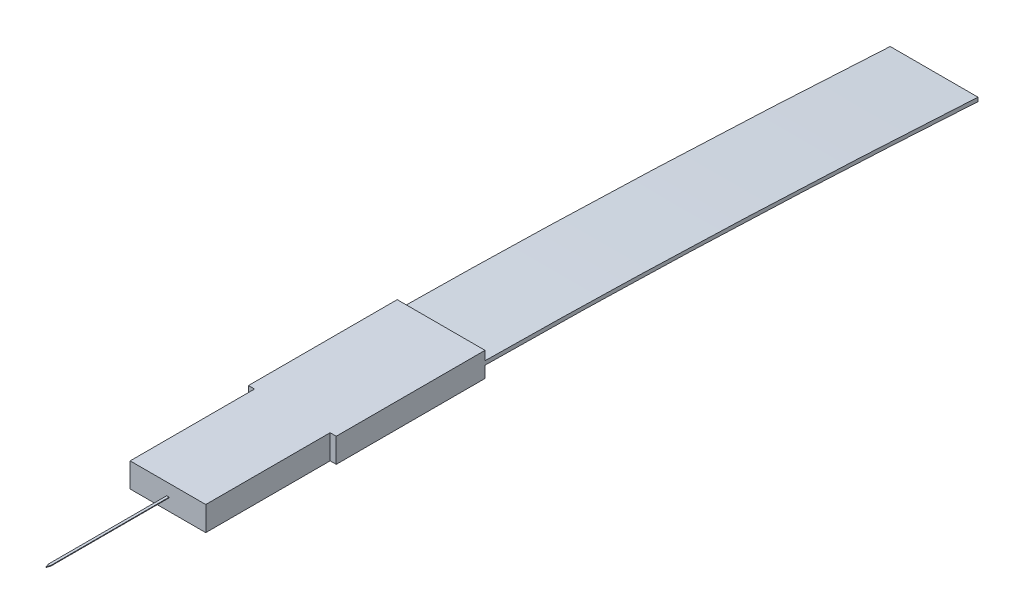
ISO-10303-21;
HEADER;
FILE_DESCRIPTION(('STEP AP214'),'2;1');
FILE_NAME('part.step','',(''),(''),'','','');
FILE_SCHEMA(('AUTOMOTIVE_DESIGN { 1 0 10303 214 1 1 1 1 }'));
ENDSEC;
DATA;
#1=APPLICATION_CONTEXT('core data for automotive mechanical design processes');
#2=APPLICATION_PROTOCOL_DEFINITION('international standard','automotive_design',2000,#1);
#3=PRODUCT_CONTEXT('',#1,'mechanical');
#4=PRODUCT('Part','Part','',(#3));
#5=PRODUCT_RELATED_PRODUCT_CATEGORY('part','',(#4));
#6=PRODUCT_DEFINITION_FORMATION('','',#4);
#7=PRODUCT_DEFINITION_CONTEXT('part definition',#1,'design');
#8=PRODUCT_DEFINITION('design','',#6,#7);
#9=PRODUCT_DEFINITION_SHAPE('','',#8);
#10=(LENGTH_UNIT() NAMED_UNIT(*) SI_UNIT(.MILLI.,.METRE.));
#11=(NAMED_UNIT(*) PLANE_ANGLE_UNIT() SI_UNIT($,.RADIAN.));
#12=(NAMED_UNIT(*) SI_UNIT($,.STERADIAN.) SOLID_ANGLE_UNIT());
#13=UNCERTAINTY_MEASURE_WITH_UNIT(LENGTH_MEASURE(1.E-05),#10,'distance_accuracy_value','');
#14=(GEOMETRIC_REPRESENTATION_CONTEXT(3) GLOBAL_UNCERTAINTY_ASSIGNED_CONTEXT((#13)) GLOBAL_UNIT_ASSIGNED_CONTEXT((#10,
#11,#12)) REPRESENTATION_CONTEXT('',''));
#15=CARTESIAN_POINT('',(0.,0.,0.));
#16=DIRECTION('',(0.,0.,1.));
#17=DIRECTION('',(1.,0.,0.));
#18=AXIS2_PLACEMENT_3D('',#15,#16,#17);
#19=CARTESIAN_POINT('',(0.,2.,-6.1));
#20=DIRECTION('',(0.,0.,-1.));
#21=DIRECTION('',(-1.,0.,0.));
#22=AXIS2_PLACEMENT_3D('',#19,#20,#21);
#23=PLANE('',#22);
#24=DIRECTION('',(0.,-1.,0.));
#25=VECTOR('',#24,1.);
#26=CARTESIAN_POINT('',(-3.6,2.,-6.1));
#27=LINE('',#26,#25);
#28=CARTESIAN_POINT('',(-3.6,0.94234822080572,-6.1));
#29=VERTEX_POINT('',#28);
#30=CARTESIAN_POINT('',(-3.6,0.,-6.1));
#31=VERTEX_POINT('',#30);
#32=EDGE_CURVE('E211',#29,#31,#27,.T.);
#33=ORIENTED_EDGE('',*,*,#32,.F.);
#34=DIRECTION('',(1.,0.,0.));
#35=VECTOR('',#34,1.);
#36=CARTESIAN_POINT('',(-3.6,0.94234822080572,-6.1));
#37=LINE('',#36,#35);
#38=CARTESIAN_POINT('',(3.6,0.94234822080572,-6.1));
#39=VERTEX_POINT('',#38);
#40=EDGE_CURVE('E202',#29,#39,#37,.T.);
#41=ORIENTED_EDGE('',*,*,#40,.T.);
#42=DIRECTION('',(0.,-1.,0.));
#43=VECTOR('',#42,1.);
#44=CARTESIAN_POINT('',(3.6,2.,-6.1));
#45=LINE('',#44,#43);
#46=CARTESIAN_POINT('',(3.6,0.,-6.1));
#47=VERTEX_POINT('',#46);
#48=EDGE_CURVE('E210',#39,#47,#45,.T.);
#49=ORIENTED_EDGE('',*,*,#48,.T.);
#50=DIRECTION('',(1.,0.,0.));
#51=VECTOR('',#50,1.);
#52=CARTESIAN_POINT('',(0.,0.,-6.1));
#53=LINE('',#52,#51);
#54=EDGE_CURVE('E254',#31,#47,#53,.T.);
#55=ORIENTED_EDGE('',*,*,#54,.F.);
#56=EDGE_LOOP('',(#33,#41,#49,#55));
#57=FACE_BOUND('',#56,.T.);
#58=ADVANCED_FACE('F60',(#57),#23,.T.);
#59=CARTESIAN_POINT('',(0.,2.,16.3));
#60=DIRECTION('',(0.,0.,-1.));
#61=DIRECTION('',(-1.,0.,0.));
#62=AXIS2_PLACEMENT_3D('',#59,#60,#61);
#63=PLANE('',#62);
#64=DIRECTION('',(1.,0.,0.));
#65=VECTOR('',#64,1.);
#66=CARTESIAN_POINT('',(0.,0.,16.3));
#67=LINE('',#66,#65);
#68=CARTESIAN_POINT('',(-3.1,0.,16.3));
#69=VERTEX_POINT('',#68);
#70=CARTESIAN_POINT('',(3.1,0.,16.3));
#71=VERTEX_POINT('',#70);
#72=EDGE_CURVE('E233',#69,#71,#67,.T.);
#73=ORIENTED_EDGE('',*,*,#72,.T.);
#74=DIRECTION('',(0.,-1.,0.));
#75=VECTOR('',#74,1.);
#76=CARTESIAN_POINT('',(3.1,2.,16.3));
#77=LINE('',#76,#75);
#78=CARTESIAN_POINT('',(3.1,2.,16.3));
#79=VERTEX_POINT('',#78);
#80=EDGE_CURVE('E223',#79,#71,#77,.T.);
#81=ORIENTED_EDGE('',*,*,#80,.F.);
#82=DIRECTION('',(1.,0.,0.));
#83=VECTOR('',#82,1.);
#84=CARTESIAN_POINT('',(0.,2.,16.3));
#85=LINE('',#84,#83);
#86=CARTESIAN_POINT('',(-3.1,2.,16.3));
#87=VERTEX_POINT('',#86);
#88=EDGE_CURVE('E235',#87,#79,#85,.T.);
#89=ORIENTED_EDGE('',*,*,#88,.F.);
#90=DIRECTION('',(0.,-1.,0.));
#91=VECTOR('',#90,1.);
#92=CARTESIAN_POINT('',(-3.1,2.,16.3));
#93=LINE('',#92,#91);
#94=EDGE_CURVE('E68',#87,#69,#93,.T.);
#95=ORIENTED_EDGE('',*,*,#94,.T.);
#96=EDGE_LOOP('',(#73,#81,#89,#95));
#97=FACE_BOUND('',#96,.T.);
#98=DIRECTION('',(0.,1.,0.));
#99=VECTOR('',#98,1.);
#100=CARTESIAN_POINT('',(0.1,0.975,16.3));
#101=LINE('',#100,#99);
#102=CARTESIAN_POINT('',(0.1,0.975,16.3));
#103=VERTEX_POINT('',#102);
#104=CARTESIAN_POINT('',(0.1,1.025,16.3));
#105=VERTEX_POINT('',#104);
#106=EDGE_CURVE('E327',#103,#105,#101,.T.);
#107=ORIENTED_EDGE('',*,*,#106,.F.);
#108=DIRECTION('',(1.,0.,0.));
#109=VECTOR('',#108,1.);
#110=CARTESIAN_POINT('',(-0.1,0.975,16.3));
#111=LINE('',#110,#109);
#112=CARTESIAN_POINT('',(-0.1,0.975,16.3));
#113=VERTEX_POINT('',#112);
#114=EDGE_CURVE('E335',#113,#103,#111,.T.);
#115=ORIENTED_EDGE('',*,*,#114,.F.);
#116=DIRECTION('',(0.,-1.,0.));
#117=VECTOR('',#116,1.);
#118=CARTESIAN_POINT('',(-0.1,0.975,16.3));
#119=LINE('',#118,#117);
#120=CARTESIAN_POINT('',(-0.1,1.025,16.3));
#121=VERTEX_POINT('',#120);
#122=EDGE_CURVE('E332',#121,#113,#119,.T.);
#123=ORIENTED_EDGE('',*,*,#122,.F.);
#124=DIRECTION('',(-1.,0.,0.));
#125=VECTOR('',#124,1.);
#126=CARTESIAN_POINT('',(-0.1,1.025,16.3));
#127=LINE('',#126,#125);
#128=EDGE_CURVE('E330',#105,#121,#127,.T.);
#129=ORIENTED_EDGE('',*,*,#128,.F.);
#130=EDGE_LOOP('',(#107,#115,#123,#129));
#131=FACE_BOUND('',#130,.T.);
#132=ADVANCED_FACE('F230',(#97,#131),#63,.F.);
#133=CARTESIAN_POINT('',(0.,2.,6.1));
#134=DIRECTION('',(0.,0.,-1.));
#135=DIRECTION('',(-1.,0.,0.));
#136=AXIS2_PLACEMENT_3D('',#133,#134,#135);
#137=PLANE('',#136);
#138=DIRECTION('',(1.,0.,0.));
#139=VECTOR('',#138,1.);
#140=CARTESIAN_POINT('',(0.,0.,6.1));
#141=LINE('',#140,#139);
#142=CARTESIAN_POINT('',(-3.6,0.,6.1));
#143=VERTEX_POINT('',#142);
#144=CARTESIAN_POINT('',(-3.1,0.,6.1));
#145=VERTEX_POINT('',#144);
#146=EDGE_CURVE('E247',#143,#145,#141,.T.);
#147=ORIENTED_EDGE('',*,*,#146,.T.);
#148=DIRECTION('',(0.,-1.,0.));
#149=VECTOR('',#148,1.);
#150=CARTESIAN_POINT('',(-3.1,2.,6.1));
#151=LINE('',#150,#149);
#152=CARTESIAN_POINT('',(-3.1,2.,6.1));
#153=VERTEX_POINT('',#152);
#154=EDGE_CURVE('E12',#153,#145,#151,.T.);
#155=ORIENTED_EDGE('',*,*,#154,.F.);
#156=DIRECTION('',(1.,0.,0.));
#157=VECTOR('',#156,1.);
#158=CARTESIAN_POINT('',(0.,2.,6.1));
#159=LINE('',#158,#157);
#160=CARTESIAN_POINT('',(-3.6,2.,6.1));
#161=VERTEX_POINT('',#160);
#162=EDGE_CURVE('E258',#161,#153,#159,.T.);
#163=ORIENTED_EDGE('',*,*,#162,.F.);
#164=DIRECTION('',(0.,-1.,0.));
#165=VECTOR('',#164,1.);
#166=CARTESIAN_POINT('',(-3.6,2.,6.1));
#167=LINE('',#166,#165);
#168=EDGE_CURVE('E214',#161,#143,#167,.T.);
#169=ORIENTED_EDGE('',*,*,#168,.T.);
#170=EDGE_LOOP('',(#147,#155,#163,#169));
#171=FACE_BOUND('',#170,.T.);
#172=ADVANCED_FACE('F368',(#171),#137,.F.);
#173=CARTESIAN_POINT('',(-3.1,2.,0.));
#174=DIRECTION('',(1.,0.,0.));
#175=DIRECTION('',(0.,0.,-1.));
#176=AXIS2_PLACEMENT_3D('',#173,#174,#175);
#177=PLANE('',#176);
#178=DIRECTION('',(0.,0.,1.));
#179=VECTOR('',#178,1.);
#180=CARTESIAN_POINT('',(-3.1,0.,0.));
#181=LINE('',#180,#179);
#182=EDGE_CURVE('E240',#145,#69,#181,.T.);
#183=ORIENTED_EDGE('',*,*,#182,.T.);
#184=ORIENTED_EDGE('',*,*,#94,.F.);
#185=DIRECTION('',(0.,0.,1.));
#186=VECTOR('',#185,1.);
#187=CARTESIAN_POINT('',(-3.1,2.,0.));
#188=LINE('',#187,#186);
#189=EDGE_CURVE('E260',#153,#87,#188,.T.);
#190=ORIENTED_EDGE('',*,*,#189,.F.);
#191=ORIENTED_EDGE('',*,*,#154,.T.);
#192=EDGE_LOOP('',(#183,#184,#190,#191));
#193=FACE_BOUND('',#192,.T.);
#194=ADVANCED_FACE('F62',(#193),#177,.F.);
#195=CARTESIAN_POINT('',(3.1,2.,0.));
#196=DIRECTION('',(1.,0.,0.));
#197=DIRECTION('',(0.,0.,-1.));
#198=AXIS2_PLACEMENT_3D('',#195,#196,#197);
#199=PLANE('',#198);
#200=DIRECTION('',(0.,0.,1.));
#201=VECTOR('',#200,1.);
#202=CARTESIAN_POINT('',(3.1,0.,0.));
#203=LINE('',#202,#201);
#204=CARTESIAN_POINT('',(3.1,0.,6.1));
#205=VERTEX_POINT('',#204);
#206=EDGE_CURVE('E243',#205,#71,#203,.T.);
#207=ORIENTED_EDGE('',*,*,#206,.F.);
#208=DIRECTION('',(0.,-1.,0.));
#209=VECTOR('',#208,1.);
#210=CARTESIAN_POINT('',(3.1,2.,6.1));
#211=LINE('',#210,#209);
#212=CARTESIAN_POINT('',(3.1,2.,6.1));
#213=VERTEX_POINT('',#212);
#214=EDGE_CURVE('E221',#213,#205,#211,.T.);
#215=ORIENTED_EDGE('',*,*,#214,.F.);
#216=DIRECTION('',(0.,0.,1.));
#217=VECTOR('',#216,1.);
#218=CARTESIAN_POINT('',(3.1,2.,0.));
#219=LINE('',#218,#217);
#220=EDGE_CURVE('E269',#213,#79,#219,.T.);
#221=ORIENTED_EDGE('',*,*,#220,.T.);
#222=ORIENTED_EDGE('',*,*,#80,.T.);
#223=EDGE_LOOP('',(#207,#215,#221,#222));
#224=FACE_BOUND('',#223,.T.);
#225=ADVANCED_FACE('F380',(#224),#199,.T.);
#226=CARTESIAN_POINT('',(3.6,0.,6.1));
#227=VERTEX_POINT('',#226);
#228=EDGE_CURVE('E245',#205,#227,#141,.T.);
#229=ORIENTED_EDGE('',*,*,#228,.T.);
#230=DIRECTION('',(0.,-1.,0.));
#231=VECTOR('',#230,1.);
#232=CARTESIAN_POINT('',(3.6,2.,6.1));
#233=LINE('',#232,#231);
#234=CARTESIAN_POINT('',(3.6,2.,6.1));
#235=VERTEX_POINT('',#234);
#236=EDGE_CURVE('E218',#235,#227,#233,.T.);
#237=ORIENTED_EDGE('',*,*,#236,.F.);
#238=EDGE_CURVE('E262',#213,#235,#159,.T.);
#239=ORIENTED_EDGE('',*,*,#238,.F.);
#240=ORIENTED_EDGE('',*,*,#214,.T.);
#241=EDGE_LOOP('',(#229,#237,#239,#240));
#242=FACE_BOUND('',#241,.T.);
#243=ADVANCED_FACE('F285',(#242),#137,.F.);
#244=CARTESIAN_POINT('',(3.6,2.,0.));
#245=DIRECTION('',(-1.,0.,0.));
#246=DIRECTION('',(0.,0.,1.));
#247=AXIS2_PLACEMENT_3D('',#244,#245,#246);
#248=PLANE('',#247);
#249=DIRECTION('',(0.,0.,-1.));
#250=VECTOR('',#249,1.);
#251=CARTESIAN_POINT('',(3.6,0.,0.));
#252=LINE('',#251,#250);
#253=EDGE_CURVE('E251',#227,#47,#252,.T.);
#254=ORIENTED_EDGE('',*,*,#253,.T.);
#255=ORIENTED_EDGE('',*,*,#48,.F.);
#256=CARTESIAN_POINT('',(3.6,0.94234822080572,-6.1));
#257=CARTESIAN_POINT('',(3.6,0.810344541487121,-24.5183183228742));
#258=CARTESIAN_POINT('',(3.6,-0.554134336022549,-46.5258868403928));
#259=B_SPLINE_CURVE_WITH_KNOTS('',2,(#256,#257,#258),.UNSPECIFIED.,.F.,.F.,(3,3),(0.,1.),.UNSPECIFIED.);
#260=CARTESIAN_POINT('',(3.6,-0.554134336022548,-46.5258868403928));
#261=VERTEX_POINT('',#260);
#262=EDGE_CURVE('E75',#39,#261,#259,.T.);
#263=ORIENTED_EDGE('',*,*,#262,.T.);
#264=DIRECTION('',(0.,1.,0.));
#265=VECTOR('',#264,1.);
#266=CARTESIAN_POINT('',(3.6,-0.234680928592633,-46.5258868403928));
#267=LINE('',#266,#265);
#268=CARTESIAN_POINT('',(3.6,-0.234680928592633,-46.5258868403928));
#269=VERTEX_POINT('',#268);
#270=EDGE_CURVE('E192',#261,#269,#267,.T.);
#271=ORIENTED_EDGE('',*,*,#270,.T.);
#272=CARTESIAN_POINT('',(3.6,-0.234680928592635,-46.5258868403928));
#273=CARTESIAN_POINT('',(3.6,1.083380730753,-24.5624307551034));
#274=CARTESIAN_POINT('',(3.6,1.26180162823563,-6.1));
#275=B_SPLINE_CURVE_WITH_KNOTS('',2,(#272,#273,#274),.UNSPECIFIED.,.F.,.F.,(3,3),(0.,1.),.UNSPECIFIED.);
#276=CARTESIAN_POINT('',(3.6,1.26180162823563,-6.1));
#277=VERTEX_POINT('',#276);
#278=EDGE_CURVE('E296',#269,#277,#275,.T.);
#279=ORIENTED_EDGE('',*,*,#278,.T.);
#280=CARTESIAN_POINT('',(3.6,2.,-6.1));
#281=VERTEX_POINT('',#280);
#282=EDGE_CURVE('E201',#281,#277,#45,.T.);
#283=ORIENTED_EDGE('',*,*,#282,.F.);
#284=DIRECTION('',(0.,0.,-1.));
#285=VECTOR('',#284,1.);
#286=CARTESIAN_POINT('',(3.6,2.,0.));
#287=LINE('',#286,#285);
#288=EDGE_CURVE('E268',#235,#281,#287,.T.);
#289=ORIENTED_EDGE('',*,*,#288,.F.);
#290=ORIENTED_EDGE('',*,*,#236,.T.);
#291=EDGE_LOOP('',(#254,#255,#263,#271,#279,#283,#289,#290));
#292=FACE_BOUND('',#291,.T.);
#293=ADVANCED_FACE('F289',(#292),#248,.F.);
#294=DIRECTION('',(1.,0.,0.));
#295=VECTOR('',#294,1.);
#296=CARTESIAN_POINT('',(-3.6,1.26180162823563,-6.1));
#297=LINE('',#296,#295);
#298=CARTESIAN_POINT('',(-3.6,1.26180162823563,-6.1));
#299=VERTEX_POINT('',#298);
#300=EDGE_CURVE('E184',#299,#277,#297,.T.);
#301=ORIENTED_EDGE('',*,*,#300,.F.);
#302=CARTESIAN_POINT('',(-3.6,2.,-6.1));
#303=VERTEX_POINT('',#302);
#304=EDGE_CURVE('E198',#303,#299,#27,.T.);
#305=ORIENTED_EDGE('',*,*,#304,.F.);
#306=DIRECTION('',(1.,0.,0.));
#307=VECTOR('',#306,1.);
#308=CARTESIAN_POINT('',(0.,2.,-6.1));
#309=LINE('',#308,#307);
#310=EDGE_CURVE('E273',#303,#281,#309,.T.);
#311=ORIENTED_EDGE('',*,*,#310,.T.);
#312=ORIENTED_EDGE('',*,*,#282,.T.);
#313=EDGE_LOOP('',(#301,#305,#311,#312));
#314=FACE_BOUND('',#313,.T.);
#315=ADVANCED_FACE('F196',(#314),#23,.T.);
#316=CARTESIAN_POINT('',(-3.6,2.,0.));
#317=DIRECTION('',(-1.,0.,0.));
#318=DIRECTION('',(0.,0.,1.));
#319=AXIS2_PLACEMENT_3D('',#316,#317,#318);
#320=PLANE('',#319);
#321=DIRECTION('',(0.,0.,-1.));
#322=VECTOR('',#321,1.);
#323=CARTESIAN_POINT('',(-3.6,0.,0.));
#324=LINE('',#323,#322);
#325=EDGE_CURVE('E256',#143,#31,#324,.T.);
#326=ORIENTED_EDGE('',*,*,#325,.F.);
#327=ORIENTED_EDGE('',*,*,#168,.F.);
#328=DIRECTION('',(0.,0.,-1.));
#329=VECTOR('',#328,1.);
#330=CARTESIAN_POINT('',(-3.6,2.,0.));
#331=LINE('',#330,#329);
#332=EDGE_CURVE('E209',#161,#303,#331,.T.);
#333=ORIENTED_EDGE('',*,*,#332,.T.);
#334=ORIENTED_EDGE('',*,*,#304,.T.);
#335=CARTESIAN_POINT('',(-3.6,-0.234680928592635,-46.5258868403928));
#336=CARTESIAN_POINT('',(-3.6,1.083380730753,-24.5624307551034));
#337=CARTESIAN_POINT('',(-3.6,1.26180162823563,-6.1));
#338=B_SPLINE_CURVE_WITH_KNOTS('',2,(#335,#336,#337),.UNSPECIFIED.,.F.,.F.,(3,3),(0.,1.),.UNSPECIFIED.);
#339=CARTESIAN_POINT('',(-3.6,-0.234680928592633,-46.5258868403928));
#340=VERTEX_POINT('',#339);
#341=EDGE_CURVE('E180',#340,#299,#338,.T.);
#342=ORIENTED_EDGE('',*,*,#341,.F.);
#343=DIRECTION('',(0.,1.,0.));
#344=VECTOR('',#343,1.);
#345=CARTESIAN_POINT('',(-3.6,-0.234680928592633,-46.5258868403928));
#346=LINE('',#345,#344);
#347=CARTESIAN_POINT('',(-3.6,-0.554134336022548,-46.5258868403928));
#348=VERTEX_POINT('',#347);
#349=EDGE_CURVE('E203',#348,#340,#346,.T.);
#350=ORIENTED_EDGE('',*,*,#349,.F.);
#351=CARTESIAN_POINT('',(-3.6,0.94234822080572,-6.1));
#352=CARTESIAN_POINT('',(-3.6,0.810344541487121,-24.5183183228742));
#353=CARTESIAN_POINT('',(-3.6,-0.554134336022549,-46.5258868403928));
#354=B_SPLINE_CURVE_WITH_KNOTS('',2,(#351,#352,#353),.UNSPECIFIED.,.F.,.F.,(3,3),(0.,1.),.UNSPECIFIED.);
#355=EDGE_CURVE('E191',#29,#348,#354,.T.);
#356=ORIENTED_EDGE('',*,*,#355,.F.);
#357=ORIENTED_EDGE('',*,*,#32,.T.);
#358=EDGE_LOOP('',(#326,#327,#333,#334,#342,#350,#356,#357));
#359=FACE_BOUND('',#358,.T.);
#360=ADVANCED_FACE('F207',(#359),#320,.T.);
#361=CARTESIAN_POINT('',(0.,2.,0.));
#362=DIRECTION('',(0.,1.,0.));
#363=DIRECTION('',(0.,0.,1.));
#364=AXIS2_PLACEMENT_3D('',#361,#362,#363);
#365=PLANE('',#364);
#366=ORIENTED_EDGE('',*,*,#162,.T.);
#367=ORIENTED_EDGE('',*,*,#189,.T.);
#368=ORIENTED_EDGE('',*,*,#88,.T.);
#369=ORIENTED_EDGE('',*,*,#220,.F.);
#370=ORIENTED_EDGE('',*,*,#238,.T.);
#371=ORIENTED_EDGE('',*,*,#288,.T.);
#372=ORIENTED_EDGE('',*,*,#310,.F.);
#373=ORIENTED_EDGE('',*,*,#332,.F.);
#374=EDGE_LOOP('',(#366,#367,#368,#369,#370,#371,#372,#373));
#375=FACE_BOUND('',#374,.T.);
#376=ADVANCED_FACE('F376',(#375),#365,.T.);
#377=CARTESIAN_POINT('',(0.,0.,0.));
#378=DIRECTION('',(0.,1.,0.));
#379=DIRECTION('',(0.,0.,1.));
#380=AXIS2_PLACEMENT_3D('',#377,#378,#379);
#381=PLANE('',#380);
#382=ORIENTED_EDGE('',*,*,#146,.F.);
#383=ORIENTED_EDGE('',*,*,#325,.T.);
#384=ORIENTED_EDGE('',*,*,#54,.T.);
#385=ORIENTED_EDGE('',*,*,#253,.F.);
#386=ORIENTED_EDGE('',*,*,#228,.F.);
#387=ORIENTED_EDGE('',*,*,#206,.T.);
#388=ORIENTED_EDGE('',*,*,#72,.F.);
#389=ORIENTED_EDGE('',*,*,#182,.F.);
#390=EDGE_LOOP('',(#382,#383,#384,#385,#386,#387,#388,#389));
#391=FACE_BOUND('',#390,.T.);
#392=ADVANCED_FACE('F239',(#391),#381,.F.);
#393=CARTESIAN_POINT('',(0.1,0.975,26.3));
#394=DIRECTION('',(-1.,0.,0.));
#395=DIRECTION('',(0.,0.,1.));
#396=AXIS2_PLACEMENT_3D('',#393,#394,#395);
#397=PLANE('',#396);
#398=DIRECTION('',(0.,0.,-1.));
#399=VECTOR('',#398,1.);
#400=CARTESIAN_POINT('',(0.1,1.025,26.3));
#401=LINE('',#400,#399);
#402=CARTESIAN_POINT('',(0.100000000000001,1.025,26.));
#403=VERTEX_POINT('',#402);
#404=EDGE_CURVE('E83',#403,#105,#401,.T.);
#405=ORIENTED_EDGE('',*,*,#404,.F.);
#406=DIRECTION('',(0.,-1.,0.));
#407=VECTOR('',#406,1.);
#408=CARTESIAN_POINT('',(0.100000000000001,1.34122776601685,26.));
#409=LINE('',#408,#407);
#410=CARTESIAN_POINT('',(0.100000000000001,0.975,26.));
#411=VERTEX_POINT('',#410);
#412=EDGE_CURVE('E319',#403,#411,#409,.T.);
#413=ORIENTED_EDGE('',*,*,#412,.T.);
#414=DIRECTION('',(0.,0.,-1.));
#415=VECTOR('',#414,1.);
#416=CARTESIAN_POINT('',(0.1,0.975,26.3));
#417=LINE('',#416,#415);
#418=EDGE_CURVE('E338',#411,#103,#417,.T.);
#419=ORIENTED_EDGE('',*,*,#418,.T.);
#420=ORIENTED_EDGE('',*,*,#106,.T.);
#421=EDGE_LOOP('',(#405,#413,#419,#420));
#422=FACE_BOUND('',#421,.T.);
#423=ADVANCED_FACE('F353',(#422),#397,.F.);
#424=CARTESIAN_POINT('',(-0.1,1.025,26.3));
#425=DIRECTION('',(0.,-1.,0.));
#426=DIRECTION('',(0.,0.,-1.));
#427=AXIS2_PLACEMENT_3D('',#424,#425,#426);
#428=PLANE('',#427);
#429=DIRECTION('',(0.,0.,-1.));
#430=VECTOR('',#429,1.);
#431=CARTESIAN_POINT('',(-0.1,1.025,26.3));
#432=LINE('',#431,#430);
#433=CARTESIAN_POINT('',(-0.100000000000002,1.025,26.));
#434=VERTEX_POINT('',#433);
#435=EDGE_CURVE('E283',#434,#121,#432,.T.);
#436=ORIENTED_EDGE('',*,*,#435,.F.);
#437=DIRECTION('',(-0.316227766016836,0.,-0.948683298050514));
#438=VECTOR('',#437,1.);
#439=CARTESIAN_POINT('',(-7.88999999999997,1.025,2.62999999999997));
#440=LINE('',#439,#438);
#441=CARTESIAN_POINT('',(0.,1.025,26.3));
#442=VERTEX_POINT('',#441);
#443=EDGE_CURVE('E311',#442,#434,#440,.T.);
#444=ORIENTED_EDGE('',*,*,#443,.F.);
#445=DIRECTION('',(-0.316227766016836,0.,0.948683298050514));
#446=VECTOR('',#445,1.);
#447=CARTESIAN_POINT('',(7.88999999999997,1.025,2.62999999999997));
#448=LINE('',#447,#446);
#449=EDGE_CURVE('E322',#403,#442,#448,.T.);
#450=ORIENTED_EDGE('',*,*,#449,.F.);
#451=ORIENTED_EDGE('',*,*,#404,.T.);
#452=ORIENTED_EDGE('',*,*,#128,.T.);
#453=EDGE_LOOP('',(#436,#444,#450,#451,#452));
#454=FACE_BOUND('',#453,.T.);
#455=ADVANCED_FACE('F351',(#454),#428,.F.);
#456=CARTESIAN_POINT('',(-0.1,0.975,26.3));
#457=DIRECTION('',(1.,0.,0.));
#458=DIRECTION('',(0.,0.,-1.));
#459=AXIS2_PLACEMENT_3D('',#456,#457,#458);
#460=PLANE('',#459);
#461=DIRECTION('',(0.,0.,-1.));
#462=VECTOR('',#461,1.);
#463=CARTESIAN_POINT('',(-0.1,0.975,26.3));
#464=LINE('',#463,#462);
#465=CARTESIAN_POINT('',(-0.100000000000001,0.975,26.));
#466=VERTEX_POINT('',#465);
#467=EDGE_CURVE('E340',#466,#113,#464,.T.);
#468=ORIENTED_EDGE('',*,*,#467,.F.);
#469=DIRECTION('',(0.,-1.,0.));
#470=VECTOR('',#469,1.);
#471=CARTESIAN_POINT('',(-0.100000000000001,1.34122776601685,26.));
#472=LINE('',#471,#470);
#473=EDGE_CURVE('E308',#434,#466,#472,.T.);
#474=ORIENTED_EDGE('',*,*,#473,.F.);
#475=ORIENTED_EDGE('',*,*,#435,.T.);
#476=ORIENTED_EDGE('',*,*,#122,.T.);
#477=EDGE_LOOP('',(#468,#474,#475,#476));
#478=FACE_BOUND('',#477,.T.);
#479=ADVANCED_FACE('F347',(#478),#460,.F.);
#480=CARTESIAN_POINT('',(-0.1,0.975,26.3));
#481=DIRECTION('',(0.,1.,0.));
#482=DIRECTION('',(0.,0.,1.));
#483=AXIS2_PLACEMENT_3D('',#480,#481,#482);
#484=PLANE('',#483);
#485=DIRECTION('',(0.316227766016836,0.,-0.948683298050514));
#486=VECTOR('',#485,1.);
#487=CARTESIAN_POINT('',(7.88999999999997,0.975,2.62999999999997));
#488=LINE('',#487,#486);
#489=CARTESIAN_POINT('',(0.,0.975,26.3));
#490=VERTEX_POINT('',#489);
#491=EDGE_CURVE('E313',#490,#411,#488,.T.);
#492=ORIENTED_EDGE('',*,*,#491,.F.);
#493=DIRECTION('',(0.316227766016836,0.,0.948683298050514));
#494=VECTOR('',#493,1.);
#495=CARTESIAN_POINT('',(-7.88999999999997,0.975,2.62999999999997));
#496=LINE('',#495,#494);
#497=EDGE_CURVE('E314',#466,#490,#496,.T.);
#498=ORIENTED_EDGE('',*,*,#497,.F.);
#499=ORIENTED_EDGE('',*,*,#467,.T.);
#500=ORIENTED_EDGE('',*,*,#114,.T.);
#501=ORIENTED_EDGE('',*,*,#418,.F.);
#502=EDGE_LOOP('',(#492,#498,#499,#500,#501));
#503=FACE_BOUND('',#502,.T.);
#504=ADVANCED_FACE('F359',(#503),#484,.F.);
#505=CARTESIAN_POINT('',(7.88999999999997,1.34122776601685,2.62999999999997));
#506=DIRECTION('',(-0.948683298050514,0.,-0.316227766016836));
#507=DIRECTION('',(-0.316227766016836,0.,0.948683298050514));
#508=AXIS2_PLACEMENT_3D('',#505,#506,#507);
#509=PLANE('',#508);
#510=ORIENTED_EDGE('',*,*,#449,.T.);
#511=DIRECTION('',(0.,-1.,0.));
#512=VECTOR('',#511,1.);
#513=CARTESIAN_POINT('',(0.,1.34122776601685,26.3));
#514=LINE('',#513,#512);
#515=EDGE_CURVE('E318',#442,#490,#514,.T.);
#516=ORIENTED_EDGE('',*,*,#515,.T.);
#517=ORIENTED_EDGE('',*,*,#491,.T.);
#518=ORIENTED_EDGE('',*,*,#412,.F.);
#519=EDGE_LOOP('',(#510,#516,#517,#518));
#520=FACE_BOUND('',#519,.T.);
#521=ADVANCED_FACE('F413',(#520),#509,.F.);
#522=CARTESIAN_POINT('',(-7.88999999999997,1.34122776601685,2.62999999999997));
#523=DIRECTION('',(0.948683298050514,0.,-0.316227766016836));
#524=DIRECTION('',(-0.316227766016836,0.,-0.948683298050514));
#525=AXIS2_PLACEMENT_3D('',#522,#523,#524);
#526=PLANE('',#525);
#527=ORIENTED_EDGE('',*,*,#443,.T.);
#528=ORIENTED_EDGE('',*,*,#473,.T.);
#529=ORIENTED_EDGE('',*,*,#497,.T.);
#530=ORIENTED_EDGE('',*,*,#515,.F.);
#531=EDGE_LOOP('',(#527,#528,#529,#530));
#532=FACE_BOUND('',#531,.T.);
#533=ADVANCED_FACE('F410',(#532),#526,.F.);
#534=DIRECTION('',(1.,0.,0.));
#535=VECTOR('',#534,1.);
#536=SURFACE_OF_LINEAR_EXTRUSION('',#338,#535);
#537=ORIENTED_EDGE('',*,*,#278,.F.);
#538=DIRECTION('',(1.,0.,0.));
#539=VECTOR('',#538,1.);
#540=CARTESIAN_POINT('',(-3.6,-0.234680928592633,-46.5258868403928));
#541=LINE('',#540,#539);
#542=EDGE_CURVE('E186',#340,#269,#541,.T.);
#543=ORIENTED_EDGE('',*,*,#542,.F.);
#544=ORIENTED_EDGE('',*,*,#341,.T.);
#545=ORIENTED_EDGE('',*,*,#300,.T.);
#546=EDGE_LOOP('',(#537,#543,#544,#545));
#547=FACE_BOUND('',#546,.T.);
#548=ADVANCED_FACE('F183',(#547),#536,.T.);
#549=CARTESIAN_POINT('',(-3.6,-0.234680928592633,-46.5258868403928));
#550=DIRECTION('',(0.,0.,-1.));
#551=DIRECTION('',(-1.,0.,0.));
#552=AXIS2_PLACEMENT_3D('',#549,#550,#551);
#553=PLANE('',#552);
#554=ORIENTED_EDGE('',*,*,#270,.F.);
#555=DIRECTION('',(1.,0.,0.));
#556=VECTOR('',#555,1.);
#557=CARTESIAN_POINT('',(-3.6,-0.554134336022548,-46.5258868403928));
#558=LINE('',#557,#556);
#559=EDGE_CURVE('E300',#348,#261,#558,.T.);
#560=ORIENTED_EDGE('',*,*,#559,.F.);
#561=ORIENTED_EDGE('',*,*,#349,.T.);
#562=ORIENTED_EDGE('',*,*,#542,.T.);
#563=EDGE_LOOP('',(#554,#560,#561,#562));
#564=FACE_BOUND('',#563,.T.);
#565=ADVANCED_FACE('F299',(#564),#553,.T.);
#566=DIRECTION('',(1.,0.,0.));
#567=VECTOR('',#566,1.);
#568=SURFACE_OF_LINEAR_EXTRUSION('',#354,#567);
#569=ORIENTED_EDGE('',*,*,#262,.F.);
#570=ORIENTED_EDGE('',*,*,#40,.F.);
#571=ORIENTED_EDGE('',*,*,#355,.T.);
#572=ORIENTED_EDGE('',*,*,#559,.T.);
#573=EDGE_LOOP('',(#569,#570,#571,#572));
#574=FACE_BOUND('',#573,.T.);
#575=ADVANCED_FACE('F404',(#574),#568,.T.);
#576=CLOSED_SHELL('',(#58,#132,#172,#194,#225,#243,#293,#315,#360,#376,#392,#423,#455,#479,#504,
#521,#533,#548,#565,#575));
#577=MANIFOLD_SOLID_BREP('B2',#576);
#578=ADVANCED_BREP_SHAPE_REPRESENTATION('',(#18,#577),#14);
#579=SHAPE_DEFINITION_REPRESENTATION(#9,#578);
ENDSEC;
END-ISO-10303-21;
